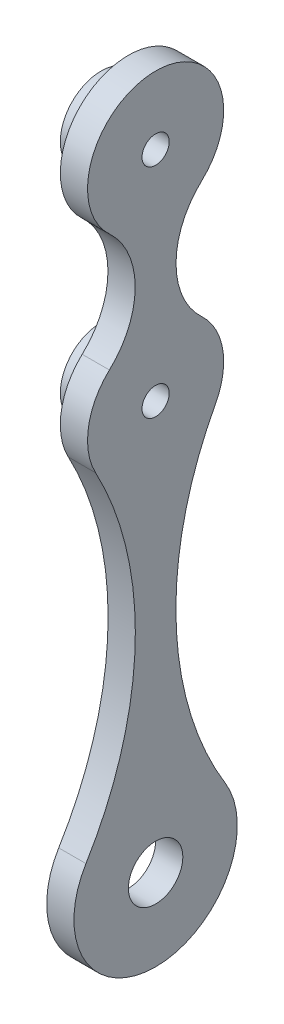
ISO-10303-21;
HEADER;
FILE_DESCRIPTION(('STEP AP214'),'2;1');
FILE_NAME('part.step','',(''),(''),'','','');
FILE_SCHEMA(('AUTOMOTIVE_DESIGN { 1 0 10303 214 1 1 1 1 }'));
ENDSEC;
DATA;
#1=APPLICATION_CONTEXT('core data for automotive mechanical design processes');
#2=APPLICATION_PROTOCOL_DEFINITION('international standard','automotive_design',2000,#1);
#3=PRODUCT_CONTEXT('',#1,'mechanical');
#4=PRODUCT('Part','Part','',(#3));
#5=PRODUCT_RELATED_PRODUCT_CATEGORY('part','',(#4));
#6=PRODUCT_DEFINITION_FORMATION('','',#4);
#7=PRODUCT_DEFINITION_CONTEXT('part definition',#1,'design');
#8=PRODUCT_DEFINITION('design','',#6,#7);
#9=PRODUCT_DEFINITION_SHAPE('','',#8);
#10=(LENGTH_UNIT() NAMED_UNIT(*) SI_UNIT(.MILLI.,.METRE.));
#11=(NAMED_UNIT(*) PLANE_ANGLE_UNIT() SI_UNIT($,.RADIAN.));
#12=(NAMED_UNIT(*) SI_UNIT($,.STERADIAN.) SOLID_ANGLE_UNIT());
#13=UNCERTAINTY_MEASURE_WITH_UNIT(LENGTH_MEASURE(1.E-05),#10,'distance_accuracy_value','');
#14=(GEOMETRIC_REPRESENTATION_CONTEXT(3) GLOBAL_UNCERTAINTY_ASSIGNED_CONTEXT((#13)) GLOBAL_UNIT_ASSIGNED_CONTEXT((#10,
#11,#12)) REPRESENTATION_CONTEXT('',''));
#15=CARTESIAN_POINT('',(0.,0.,0.));
#16=DIRECTION('',(0.,0.,1.));
#17=DIRECTION('',(1.,0.,0.));
#18=AXIS2_PLACEMENT_3D('',#15,#16,#17);
#19=CARTESIAN_POINT('',(10.,-40.,36.9642857142857));
#20=DIRECTION('',(-1.,0.,0.));
#21=DIRECTION('',(0.,0.,1.));
#22=AXIS2_PLACEMENT_3D('',#19,#20,#21);
#23=CYLINDRICAL_SURFACE('',#22,29.4642857142857);
#24=CARTESIAN_POINT('',(0.,-40.,36.9642857142857));
#25=DIRECTION('',(1.,0.,0.));
#26=DIRECTION('',(0.,0.,-1.));
#27=AXIS2_PLACEMENT_3D('',#24,#25,#26);
#28=CIRCLE('',#27,29.4642857142857);
#29=CARTESIAN_POINT('',(0.,-18.3606557377049,16.9672131147541));
#30=VERTEX_POINT('',#29);
#31=CARTESIAN_POINT('',(0.,-61.6393442622951,16.9672131147541));
#32=VERTEX_POINT('',#31);
#33=EDGE_CURVE('E227',#30,#32,#28,.F.);
#34=ORIENTED_EDGE('',*,*,#33,.T.);
#35=DIRECTION('',(-1.,0.,0.));
#36=VECTOR('',#35,1.);
#37=CARTESIAN_POINT('',(10.,-61.6393442622951,16.9672131147541));
#38=LINE('',#37,#36);
#39=CARTESIAN_POINT('',(10.,-61.6393442622951,16.9672131147541));
#40=VERTEX_POINT('',#39);
#41=EDGE_CURVE('E248',#40,#32,#38,.T.);
#42=ORIENTED_EDGE('',*,*,#41,.F.);
#43=CARTESIAN_POINT('',(10.,-40.,36.9642857142857));
#44=DIRECTION('',(1.,0.,0.));
#45=DIRECTION('',(0.,0.,-1.));
#46=AXIS2_PLACEMENT_3D('',#43,#44,#45);
#47=CIRCLE('',#46,29.4642857142857);
#48=CARTESIAN_POINT('',(10.,-18.3606557377049,16.9672131147541));
#49=VERTEX_POINT('',#48);
#50=EDGE_CURVE('E180',#49,#40,#47,.F.);
#51=ORIENTED_EDGE('',*,*,#50,.F.);
#52=DIRECTION('',(-1.,0.,0.));
#53=VECTOR('',#52,1.);
#54=CARTESIAN_POINT('',(10.,-18.3606557377049,16.9672131147541));
#55=LINE('',#54,#53);
#56=EDGE_CURVE('E251',#49,#30,#55,.T.);
#57=ORIENTED_EDGE('',*,*,#56,.T.);
#58=EDGE_LOOP('',(#34,#42,#51,#57));
#59=FACE_BOUND('',#58,.T.);
#60=ADVANCED_FACE('F123',(#59),#23,.F.);
#61=CARTESIAN_POINT('',(10.,-80.,0.));
#62=DIRECTION('',(-1.,0.,0.));
#63=DIRECTION('',(0.,0.,1.));
#64=AXIS2_PLACEMENT_3D('',#61,#62,#63);
#65=CYLINDRICAL_SURFACE('',#64,25.);
#66=CARTESIAN_POINT('',(0.,-80.,0.));
#67=DIRECTION('',(1.,0.,0.));
#68=DIRECTION('',(0.,0.,-1.));
#69=AXIS2_PLACEMENT_3D('',#66,#67,#68);
#70=CIRCLE('',#69,25.);
#71=CARTESIAN_POINT('',(0.,-91.7990522807326,22.0404710765569));
#72=VERTEX_POINT('',#71);
#73=EDGE_CURVE('E229',#32,#72,#70,.T.);
#74=ORIENTED_EDGE('',*,*,#73,.T.);
#75=DIRECTION('',(-1.,0.,0.));
#76=VECTOR('',#75,1.);
#77=CARTESIAN_POINT('',(10.,-91.7990522807326,22.0404710765569));
#78=LINE('',#77,#76);
#79=CARTESIAN_POINT('',(10.,-91.7990522807326,22.0404710765569));
#80=VERTEX_POINT('',#79);
#81=EDGE_CURVE('E245',#80,#72,#78,.T.);
#82=ORIENTED_EDGE('',*,*,#81,.F.);
#83=CARTESIAN_POINT('',(10.,-80.,0.));
#84=DIRECTION('',(1.,0.,0.));
#85=DIRECTION('',(0.,0.,-1.));
#86=AXIS2_PLACEMENT_3D('',#83,#84,#85);
#87=CIRCLE('',#86,25.);
#88=EDGE_CURVE('E213',#40,#80,#87,.T.);
#89=ORIENTED_EDGE('',*,*,#88,.F.);
#90=ORIENTED_EDGE('',*,*,#41,.T.);
#91=EDGE_LOOP('',(#74,#82,#89,#90));
#92=FACE_BOUND('',#91,.T.);
#93=ADVANCED_FACE('F278',(#92),#65,.T.);
#94=CARTESIAN_POINT('',(10.,-149.97456329341,130.711543746744));
#95=DIRECTION('',(-1.,0.,0.));
#96=DIRECTION('',(0.,0.,1.));
#97=AXIS2_PLACEMENT_3D('',#94,#95,#96);
#98=CYLINDRICAL_SURFACE('',#97,123.263101197703);
#99=CARTESIAN_POINT('',(0.,-149.97456329341,130.711543746744));
#100=DIRECTION('',(1.,0.,0.));
#101=DIRECTION('',(0.,0.,-1.));
#102=AXIS2_PLACEMENT_3D('',#99,#100,#101);
#103=CIRCLE('',#102,123.263101197703);
#104=CARTESIAN_POINT('',(0.,-214.335674520243,25.5857168604721));
#105=VERTEX_POINT('',#104);
#106=EDGE_CURVE('E231',#72,#105,#103,.F.);
#107=ORIENTED_EDGE('',*,*,#106,.T.);
#108=DIRECTION('',(-1.,0.,0.));
#109=VECTOR('',#108,1.);
#110=CARTESIAN_POINT('',(10.,-214.335674520243,25.5857168604721));
#111=LINE('',#110,#109);
#112=CARTESIAN_POINT('',(10.,-214.335674520243,25.5857168604721));
#113=VERTEX_POINT('',#112);
#114=EDGE_CURVE('E243',#113,#105,#111,.T.);
#115=ORIENTED_EDGE('',*,*,#114,.F.);
#116=CARTESIAN_POINT('',(10.,-149.97456329341,130.711543746744));
#117=DIRECTION('',(1.,0.,0.));
#118=DIRECTION('',(0.,0.,-1.));
#119=AXIS2_PLACEMENT_3D('',#116,#117,#118);
#120=CIRCLE('',#119,123.263101197703);
#121=EDGE_CURVE('E220',#80,#113,#120,.F.);
#122=ORIENTED_EDGE('',*,*,#121,.F.);
#123=ORIENTED_EDGE('',*,*,#81,.T.);
#124=EDGE_LOOP('',(#107,#115,#122,#123));
#125=FACE_BOUND('',#124,.T.);
#126=ADVANCED_FACE('F285',(#125),#98,.F.);
#127=CARTESIAN_POINT('',(10.,-149.97456329341,-130.711543746744));
#128=DIRECTION('',(-1.,0.,0.));
#129=DIRECTION('',(0.,0.,1.));
#130=AXIS2_PLACEMENT_3D('',#127,#128,#129);
#131=CYLINDRICAL_SURFACE('',#130,123.263101197703);
#132=CARTESIAN_POINT('',(0.,-149.97456329341,-130.711543746744));
#133=DIRECTION('',(1.,0.,0.));
#134=DIRECTION('',(0.,0.,-1.));
#135=AXIS2_PLACEMENT_3D('',#132,#133,#134);
#136=CIRCLE('',#135,123.263101197703);
#137=CARTESIAN_POINT('',(0.,-91.7990522807326,-22.0404710765569));
#138=VERTEX_POINT('',#137);
#139=CARTESIAN_POINT('',(0.,-214.335674520243,-25.5857168604721));
#140=VERTEX_POINT('',#139);
#141=EDGE_CURVE('E202',#138,#140,#136,.T.);
#142=ORIENTED_EDGE('',*,*,#141,.F.);
#143=DIRECTION('',(-1.,0.,0.));
#144=VECTOR('',#143,1.);
#145=CARTESIAN_POINT('',(10.,-91.7990522807326,-22.0404710765569));
#146=LINE('',#145,#144);
#147=CARTESIAN_POINT('',(10.,-91.7990522807326,-22.0404710765569));
#148=VERTEX_POINT('',#147);
#149=EDGE_CURVE('E196',#148,#138,#146,.T.);
#150=ORIENTED_EDGE('',*,*,#149,.F.);
#151=CARTESIAN_POINT('',(10.,-149.97456329341,-130.711543746744));
#152=DIRECTION('',(1.,0.,0.));
#153=DIRECTION('',(0.,0.,-1.));
#154=AXIS2_PLACEMENT_3D('',#151,#152,#153);
#155=CIRCLE('',#154,123.263101197703);
#156=CARTESIAN_POINT('',(10.,-214.335674520243,-25.5857168604721));
#157=VERTEX_POINT('',#156);
#158=EDGE_CURVE('E200',#148,#157,#155,.T.);
#159=ORIENTED_EDGE('',*,*,#158,.T.);
#160=DIRECTION('',(-1.,0.,0.));
#161=VECTOR('',#160,1.);
#162=CARTESIAN_POINT('',(10.,-214.335674520243,-25.5857168604721));
#163=LINE('',#162,#161);
#164=EDGE_CURVE('E205',#157,#140,#163,.T.);
#165=ORIENTED_EDGE('',*,*,#164,.T.);
#166=EDGE_LOOP('',(#142,#150,#159,#165));
#167=FACE_BOUND('',#166,.T.);
#168=ADVANCED_FACE('F198',(#167),#131,.F.);
#169=CARTESIAN_POINT('',(0.,-61.6393442622951,-16.9672131147541));
#170=VERTEX_POINT('',#169);
#171=EDGE_CURVE('E232',#138,#170,#70,.T.);
#172=ORIENTED_EDGE('',*,*,#171,.T.);
#173=DIRECTION('',(-1.,0.,0.));
#174=VECTOR('',#173,1.);
#175=CARTESIAN_POINT('',(10.,-61.6393442622951,-16.9672131147541));
#176=LINE('',#175,#174);
#177=CARTESIAN_POINT('',(10.,-61.6393442622951,-16.9672131147541));
#178=VERTEX_POINT('',#177);
#179=EDGE_CURVE('E167',#178,#170,#176,.T.);
#180=ORIENTED_EDGE('',*,*,#179,.F.);
#181=EDGE_CURVE('E207',#148,#178,#87,.T.);
#182=ORIENTED_EDGE('',*,*,#181,.F.);
#183=ORIENTED_EDGE('',*,*,#149,.T.);
#184=EDGE_LOOP('',(#172,#180,#182,#183));
#185=FACE_BOUND('',#184,.T.);
#186=ADVANCED_FACE('F208',(#185),#65,.T.);
#187=CARTESIAN_POINT('',(10.,-40.,-36.9642857142857));
#188=DIRECTION('',(-1.,0.,0.));
#189=DIRECTION('',(0.,0.,1.));
#190=AXIS2_PLACEMENT_3D('',#187,#188,#189);
#191=CYLINDRICAL_SURFACE('',#190,29.4642857142857);
#192=CARTESIAN_POINT('',(0.,-40.,-36.9642857142857));
#193=DIRECTION('',(1.,0.,0.));
#194=DIRECTION('',(0.,0.,-1.));
#195=AXIS2_PLACEMENT_3D('',#192,#193,#194);
#196=CIRCLE('',#195,29.4642857142857);
#197=CARTESIAN_POINT('',(0.,-18.3606557377049,-16.9672131147541));
#198=VERTEX_POINT('',#197);
#199=EDGE_CURVE('E236',#198,#170,#196,.T.);
#200=ORIENTED_EDGE('',*,*,#199,.F.);
#201=DIRECTION('',(-1.,0.,0.));
#202=VECTOR('',#201,1.);
#203=CARTESIAN_POINT('',(10.,-18.3606557377049,-16.9672131147541));
#204=LINE('',#203,#202);
#205=CARTESIAN_POINT('',(10.,-18.3606557377049,-16.9672131147541));
#206=VERTEX_POINT('',#205);
#207=EDGE_CURVE('E140',#206,#198,#204,.T.);
#208=ORIENTED_EDGE('',*,*,#207,.F.);
#209=CARTESIAN_POINT('',(10.,-40.,-36.9642857142857));
#210=DIRECTION('',(1.,0.,0.));
#211=DIRECTION('',(0.,0.,-1.));
#212=AXIS2_PLACEMENT_3D('',#209,#210,#211);
#213=CIRCLE('',#212,29.4642857142857);
#214=EDGE_CURVE('E211',#206,#178,#213,.T.);
#215=ORIENTED_EDGE('',*,*,#214,.T.);
#216=ORIENTED_EDGE('',*,*,#179,.T.);
#217=EDGE_LOOP('',(#200,#208,#215,#216));
#218=FACE_BOUND('',#217,.T.);
#219=ADVANCED_FACE('F268',(#218),#191,.F.);
#220=CARTESIAN_POINT('',(10.,0.,0.));
#221=DIRECTION('',(-1.,0.,0.));
#222=DIRECTION('',(0.,0.,1.));
#223=AXIS2_PLACEMENT_3D('',#220,#221,#222);
#224=CYLINDRICAL_SURFACE('',#223,25.);
#225=CARTESIAN_POINT('',(0.,0.,0.));
#226=DIRECTION('',(1.,0.,0.));
#227=DIRECTION('',(0.,0.,-1.));
#228=AXIS2_PLACEMENT_3D('',#225,#226,#227);
#229=CIRCLE('',#228,25.);
#230=EDGE_CURVE('E225',#198,#30,#229,.T.);
#231=ORIENTED_EDGE('',*,*,#230,.T.);
#232=ORIENTED_EDGE('',*,*,#56,.F.);
#233=CARTESIAN_POINT('',(10.,0.,0.));
#234=DIRECTION('',(1.,0.,0.));
#235=DIRECTION('',(0.,0.,-1.));
#236=AXIS2_PLACEMENT_3D('',#233,#234,#235);
#237=CIRCLE('',#236,25.);
#238=EDGE_CURVE('E239',#206,#49,#237,.T.);
#239=ORIENTED_EDGE('',*,*,#238,.F.);
#240=ORIENTED_EDGE('',*,*,#207,.T.);
#241=EDGE_LOOP('',(#231,#232,#239,#240));
#242=FACE_BOUND('',#241,.T.);
#243=ADVANCED_FACE('F270',(#242),#224,.T.);
#244=CARTESIAN_POINT('',(0.,0.,0.));
#245=DIRECTION('',(1.,0.,0.));
#246=DIRECTION('',(0.,0.,-1.));
#247=AXIS2_PLACEMENT_3D('',#244,#245,#246);
#248=PLANE('',#247);
#249=CARTESIAN_POINT('',(0.,-80.,0.));
#250=DIRECTION('',(1.,0.,0.));
#251=DIRECTION('',(0.,0.,-1.));
#252=AXIS2_PLACEMENT_3D('',#249,#250,#251);
#253=CIRCLE('',#252,15.);
#254=CARTESIAN_POINT('',(0.,-80.,-15.));
#255=VERTEX_POINT('',#254);
#256=EDGE_CURVE('E12',#255,#255,#253,.F.);
#257=ORIENTED_EDGE('',*,*,#256,.F.);
#258=EDGE_LOOP('',(#257));
#259=FACE_BOUND('',#258,.T.);
#260=CARTESIAN_POINT('',(0.,0.,0.));
#261=DIRECTION('',(-1.,0.,0.));
#262=DIRECTION('',(0.,0.,1.));
#263=AXIS2_PLACEMENT_3D('',#260,#261,#262);
#264=CIRCLE('',#263,15.);
#265=CARTESIAN_POINT('',(0.,0.,15.));
#266=VERTEX_POINT('',#265);
#267=EDGE_CURVE('E132',#266,#266,#264,.T.);
#268=ORIENTED_EDGE('',*,*,#267,.F.);
#269=EDGE_LOOP('',(#268));
#270=FACE_BOUND('',#269,.T.);
#271=ORIENTED_EDGE('',*,*,#230,.F.);
#272=ORIENTED_EDGE('',*,*,#199,.T.);
#273=ORIENTED_EDGE('',*,*,#171,.F.);
#274=ORIENTED_EDGE('',*,*,#141,.T.);
#275=CARTESIAN_POINT('',(0.,-230.,0.));
#276=DIRECTION('',(1.,0.,0.));
#277=DIRECTION('',(0.,0.,-1.));
#278=AXIS2_PLACEMENT_3D('',#275,#276,#277);
#279=CIRCLE('',#278,30.);
#280=EDGE_CURVE('E256',#105,#140,#279,.T.);
#281=ORIENTED_EDGE('',*,*,#280,.F.);
#282=ORIENTED_EDGE('',*,*,#106,.F.);
#283=ORIENTED_EDGE('',*,*,#73,.F.);
#284=ORIENTED_EDGE('',*,*,#33,.F.);
#285=EDGE_LOOP('',(#271,#272,#273,#274,#281,#282,#283,#284));
#286=FACE_BOUND('',#285,.T.);
#287=CARTESIAN_POINT('',(0.,-230.,0.));
#288=DIRECTION('',(1.,0.,0.));
#289=DIRECTION('',(0.,0.,-1.));
#290=AXIS2_PLACEMENT_3D('',#287,#288,#289);
#291=CIRCLE('',#290,10.);
#292=CARTESIAN_POINT('',(0.,-230.,-10.));
#293=VERTEX_POINT('',#292);
#294=EDGE_CURVE('E257',#293,#293,#291,.T.);
#295=ORIENTED_EDGE('',*,*,#294,.T.);
#296=EDGE_LOOP('',(#295));
#297=FACE_BOUND('',#296,.T.);
#298=ADVANCED_FACE('F266',(#259,#270,#286,#297),#248,.F.);
#299=CARTESIAN_POINT('',(10.,0.,0.));
#300=DIRECTION('',(1.,0.,0.));
#301=DIRECTION('',(0.,0.,-1.));
#302=AXIS2_PLACEMENT_3D('',#299,#300,#301);
#303=PLANE('',#302);
#304=CARTESIAN_POINT('',(10.,-80.,0.));
#305=DIRECTION('',(-1.,0.,0.));
#306=DIRECTION('',(0.,0.,1.));
#307=AXIS2_PLACEMENT_3D('',#304,#305,#306);
#308=CIRCLE('',#307,5.00000000000001);
#309=CARTESIAN_POINT('',(10.,-80.,5.00000000000001));
#310=VERTEX_POINT('',#309);
#311=EDGE_CURVE('E441',#310,#310,#308,.T.);
#312=ORIENTED_EDGE('',*,*,#311,.T.);
#313=EDGE_LOOP('',(#312));
#314=FACE_BOUND('',#313,.T.);
#315=CARTESIAN_POINT('',(10.,0.,0.));
#316=DIRECTION('',(-1.,0.,0.));
#317=DIRECTION('',(0.,0.,1.));
#318=AXIS2_PLACEMENT_3D('',#315,#316,#317);
#319=CIRCLE('',#318,5.);
#320=CARTESIAN_POINT('',(10.,0.,5.));
#321=VERTEX_POINT('',#320);
#322=EDGE_CURVE('E431',#321,#321,#319,.T.);
#323=ORIENTED_EDGE('',*,*,#322,.T.);
#324=EDGE_LOOP('',(#323));
#325=FACE_BOUND('',#324,.T.);
#326=ORIENTED_EDGE('',*,*,#238,.T.);
#327=ORIENTED_EDGE('',*,*,#50,.T.);
#328=ORIENTED_EDGE('',*,*,#88,.T.);
#329=ORIENTED_EDGE('',*,*,#121,.T.);
#330=CARTESIAN_POINT('',(10.,-230.,0.));
#331=DIRECTION('',(1.,0.,0.));
#332=DIRECTION('',(0.,0.,-1.));
#333=AXIS2_PLACEMENT_3D('',#330,#331,#332);
#334=CIRCLE('',#333,30.);
#335=EDGE_CURVE('E219',#113,#157,#334,.T.);
#336=ORIENTED_EDGE('',*,*,#335,.T.);
#337=ORIENTED_EDGE('',*,*,#158,.F.);
#338=ORIENTED_EDGE('',*,*,#181,.T.);
#339=ORIENTED_EDGE('',*,*,#214,.F.);
#340=EDGE_LOOP('',(#326,#327,#328,#329,#336,#337,#338,#339));
#341=FACE_BOUND('',#340,.T.);
#342=CARTESIAN_POINT('',(10.,-230.,0.));
#343=DIRECTION('',(1.,0.,0.));
#344=DIRECTION('',(0.,0.,-1.));
#345=AXIS2_PLACEMENT_3D('',#342,#343,#344);
#346=CIRCLE('',#345,10.);
#347=CARTESIAN_POINT('',(10.,-230.,-10.));
#348=VERTEX_POINT('',#347);
#349=EDGE_CURVE('E253',#348,#348,#346,.T.);
#350=ORIENTED_EDGE('',*,*,#349,.F.);
#351=EDGE_LOOP('',(#350));
#352=FACE_BOUND('',#351,.T.);
#353=ADVANCED_FACE('F215',(#314,#325,#341,#352),#303,.T.);
#354=CARTESIAN_POINT('',(10.,-230.,0.));
#355=DIRECTION('',(-1.,0.,0.));
#356=DIRECTION('',(0.,0.,1.));
#357=AXIS2_PLACEMENT_3D('',#354,#355,#356);
#358=CYLINDRICAL_SURFACE('',#357,10.);
#359=ORIENTED_EDGE('',*,*,#349,.T.);
#360=EDGE_LOOP('',(#359));
#361=FACE_BOUND('',#360,.T.);
#362=ORIENTED_EDGE('',*,*,#294,.F.);
#363=EDGE_LOOP('',(#362));
#364=FACE_BOUND('',#363,.T.);
#365=ADVANCED_FACE('F289',(#361,#364),#358,.F.);
#366=CARTESIAN_POINT('',(10.,-230.,0.));
#367=DIRECTION('',(-1.,0.,0.));
#368=DIRECTION('',(0.,0.,1.));
#369=AXIS2_PLACEMENT_3D('',#366,#367,#368);
#370=CYLINDRICAL_SURFACE('',#369,30.);
#371=ORIENTED_EDGE('',*,*,#335,.F.);
#372=ORIENTED_EDGE('',*,*,#114,.T.);
#373=ORIENTED_EDGE('',*,*,#280,.T.);
#374=ORIENTED_EDGE('',*,*,#164,.F.);
#375=EDGE_LOOP('',(#371,#372,#373,#374));
#376=FACE_BOUND('',#375,.T.);
#377=ADVANCED_FACE('F125',(#376),#370,.T.);
#378=CARTESIAN_POINT('',(-10.,0.,0.));
#379=DIRECTION('',(1.,0.,0.));
#380=DIRECTION('',(0.,0.,-1.));
#381=AXIS2_PLACEMENT_3D('',#378,#379,#380);
#382=CYLINDRICAL_SURFACE('',#381,15.);
#383=CARTESIAN_POINT('',(-10.,0.,0.));
#384=DIRECTION('',(-1.,0.,0.));
#385=DIRECTION('',(0.,0.,1.));
#386=AXIS2_PLACEMENT_3D('',#383,#384,#385);
#387=CIRCLE('',#386,15.);
#388=CARTESIAN_POINT('',(-10.,0.,15.));
#389=VERTEX_POINT('',#388);
#390=EDGE_CURVE('E260',#389,#389,#387,.T.);
#391=ORIENTED_EDGE('',*,*,#390,.F.);
#392=EDGE_LOOP('',(#391));
#393=FACE_BOUND('',#392,.T.);
#394=ORIENTED_EDGE('',*,*,#267,.T.);
#395=EDGE_LOOP('',(#394));
#396=FACE_BOUND('',#395,.T.);
#397=ADVANCED_FACE('F292',(#393,#396),#382,.T.);
#398=CARTESIAN_POINT('',(-10.,0.,0.));
#399=DIRECTION('',(-1.,0.,0.));
#400=DIRECTION('',(0.,0.,1.));
#401=AXIS2_PLACEMENT_3D('',#398,#399,#400);
#402=PLANE('',#401);
#403=CARTESIAN_POINT('',(-10.,0.,0.));
#404=DIRECTION('',(-1.,0.,0.));
#405=DIRECTION('',(0.,0.,1.));
#406=AXIS2_PLACEMENT_3D('',#403,#404,#405);
#407=CIRCLE('',#406,5.);
#408=CARTESIAN_POINT('',(-10.,0.,5.));
#409=VERTEX_POINT('',#408);
#410=EDGE_CURVE('E434',#409,#409,#407,.T.);
#411=ORIENTED_EDGE('',*,*,#410,.F.);
#412=EDGE_LOOP('',(#411));
#413=FACE_BOUND('',#412,.T.);
#414=ORIENTED_EDGE('',*,*,#390,.T.);
#415=EDGE_LOOP('',(#414));
#416=FACE_BOUND('',#415,.T.);
#417=ADVANCED_FACE('F301',(#413,#416),#402,.T.);
#418=CARTESIAN_POINT('',(-10.,-80.,0.));
#419=DIRECTION('',(1.,0.,0.));
#420=DIRECTION('',(0.,0.,-1.));
#421=AXIS2_PLACEMENT_3D('',#418,#419,#420);
#422=CYLINDRICAL_SURFACE('',#421,15.);
#423=CARTESIAN_POINT('',(-10.,-80.,0.));
#424=DIRECTION('',(-1.,0.,0.));
#425=DIRECTION('',(0.,0.,1.));
#426=AXIS2_PLACEMENT_3D('',#423,#424,#425);
#427=CIRCLE('',#426,15.);
#428=CARTESIAN_POINT('',(-10.,-80.,15.));
#429=VERTEX_POINT('',#428);
#430=EDGE_CURVE('E439',#429,#429,#427,.T.);
#431=ORIENTED_EDGE('',*,*,#430,.F.);
#432=EDGE_LOOP('',(#431));
#433=FACE_BOUND('',#432,.T.);
#434=ORIENTED_EDGE('',*,*,#256,.T.);
#435=EDGE_LOOP('',(#434));
#436=FACE_BOUND('',#435,.T.);
#437=ADVANCED_FACE('F307',(#433,#436),#422,.T.);
#438=CARTESIAN_POINT('',(-10.,-80.,0.));
#439=DIRECTION('',(-1.,0.,0.));
#440=DIRECTION('',(0.,0.,1.));
#441=AXIS2_PLACEMENT_3D('',#438,#439,#440);
#442=PLANE('',#441);
#443=CARTESIAN_POINT('',(-10.,-80.,0.));
#444=DIRECTION('',(-1.,0.,0.));
#445=DIRECTION('',(0.,0.,1.));
#446=AXIS2_PLACEMENT_3D('',#443,#444,#445);
#447=CIRCLE('',#446,5.00000000000001);
#448=CARTESIAN_POINT('',(-10.,-80.,5.00000000000001));
#449=VERTEX_POINT('',#448);
#450=EDGE_CURVE('E436',#449,#449,#447,.T.);
#451=ORIENTED_EDGE('',*,*,#450,.F.);
#452=EDGE_LOOP('',(#451));
#453=FACE_BOUND('',#452,.T.);
#454=ORIENTED_EDGE('',*,*,#430,.T.);
#455=EDGE_LOOP('',(#454));
#456=FACE_BOUND('',#455,.T.);
#457=ADVANCED_FACE('F384',(#453,#456),#442,.T.);
#458=CARTESIAN_POINT('',(10.,-80.,0.));
#459=DIRECTION('',(-1.,0.,0.));
#460=DIRECTION('',(0.,0.,1.));
#461=AXIS2_PLACEMENT_3D('',#458,#459,#460);
#462=CYLINDRICAL_SURFACE('',#461,5.00000000000001);
#463=ORIENTED_EDGE('',*,*,#311,.F.);
#464=EDGE_LOOP('',(#463));
#465=FACE_BOUND('',#464,.T.);
#466=ORIENTED_EDGE('',*,*,#450,.T.);
#467=EDGE_LOOP('',(#466));
#468=FACE_BOUND('',#467,.T.);
#469=ADVANCED_FACE('F404',(#465,#468),#462,.F.);
#470=CARTESIAN_POINT('',(10.,0.,0.));
#471=DIRECTION('',(-1.,0.,0.));
#472=DIRECTION('',(0.,0.,1.));
#473=AXIS2_PLACEMENT_3D('',#470,#471,#472);
#474=CYLINDRICAL_SURFACE('',#473,5.);
#475=ORIENTED_EDGE('',*,*,#322,.F.);
#476=EDGE_LOOP('',(#475));
#477=FACE_BOUND('',#476,.T.);
#478=ORIENTED_EDGE('',*,*,#410,.T.);
#479=EDGE_LOOP('',(#478));
#480=FACE_BOUND('',#479,.T.);
#481=ADVANCED_FACE('F414',(#477,#480),#474,.F.);
#482=CLOSED_SHELL('',(#60,#93,#126,#168,#186,#219,#243,#298,#353,#365,#377,#397,#417,#437,#457,
#469,#481));
#483=MANIFOLD_SOLID_BREP('B2',#482);
#484=ADVANCED_BREP_SHAPE_REPRESENTATION('',(#18,#483),#14);
#485=SHAPE_DEFINITION_REPRESENTATION(#9,#484);
ENDSEC;
END-ISO-10303-21;
